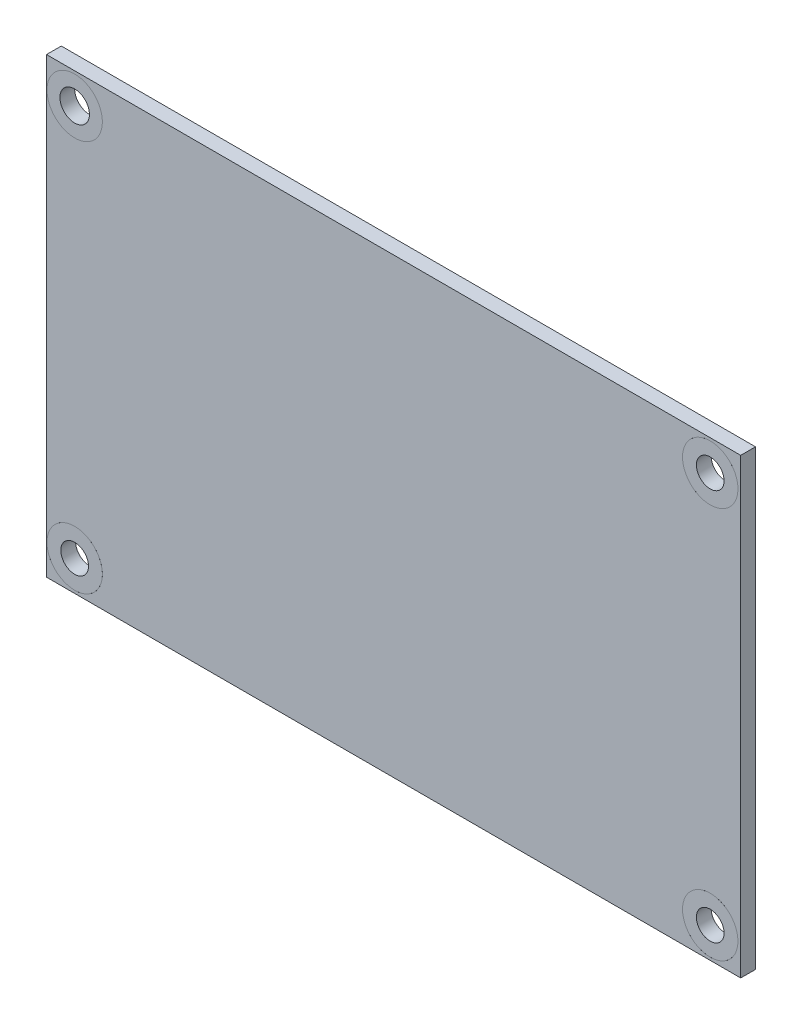
ISO-10303-21;
HEADER;
FILE_DESCRIPTION(('STEP AP214'),'2;1');
FILE_NAME('part.step','',(''),(''),'','','');
FILE_SCHEMA(('AUTOMOTIVE_DESIGN { 1 0 10303 214 1 1 1 1 }'));
ENDSEC;
DATA;
#1=APPLICATION_CONTEXT('core data for automotive mechanical design processes');
#2=APPLICATION_PROTOCOL_DEFINITION('international standard','automotive_design',2000,#1);
#3=PRODUCT_CONTEXT('',#1,'mechanical');
#4=PRODUCT('Part','Part','',(#3));
#5=PRODUCT_RELATED_PRODUCT_CATEGORY('part','',(#4));
#6=PRODUCT_DEFINITION_FORMATION('','',#4);
#7=PRODUCT_DEFINITION_CONTEXT('part definition',#1,'design');
#8=PRODUCT_DEFINITION('design','',#6,#7);
#9=PRODUCT_DEFINITION_SHAPE('','',#8);
#10=(LENGTH_UNIT() NAMED_UNIT(*) SI_UNIT(.MILLI.,.METRE.));
#11=(NAMED_UNIT(*) PLANE_ANGLE_UNIT() SI_UNIT($,.RADIAN.));
#12=(NAMED_UNIT(*) SI_UNIT($,.STERADIAN.) SOLID_ANGLE_UNIT());
#13=UNCERTAINTY_MEASURE_WITH_UNIT(LENGTH_MEASURE(1.E-05),#10,'distance_accuracy_value','');
#14=(GEOMETRIC_REPRESENTATION_CONTEXT(3) GLOBAL_UNCERTAINTY_ASSIGNED_CONTEXT((#13)) GLOBAL_UNIT_ASSIGNED_CONTEXT((#10,
#11,#12)) REPRESENTATION_CONTEXT('',''));
#15=CARTESIAN_POINT('',(0.,0.,0.));
#16=DIRECTION('',(0.,0.,1.));
#17=DIRECTION('',(1.,0.,0.));
#18=AXIS2_PLACEMENT_3D('',#15,#16,#17);
#19=CARTESIAN_POINT('',(-34.54,-21.21,10.0854813742386));
#20=DIRECTION('',(0.,0.,-1.));
#21=DIRECTION('',(-1.,0.,0.));
#22=AXIS2_PLACEMENT_3D('',#19,#20,#21);
#23=CYLINDRICAL_SURFACE('',#22,3.);
#24=CARTESIAN_POINT('',(-34.54,-21.21,0.));
#25=DIRECTION('',(0.,0.,-1.));
#26=DIRECTION('',(-1.,0.,0.));
#27=AXIS2_PLACEMENT_3D('',#24,#25,#26);
#28=CIRCLE('',#27,3.);
#29=CARTESIAN_POINT('',(-37.54,-21.21,0.));
#30=VERTEX_POINT('',#29);
#31=EDGE_CURVE('E61',#30,#30,#28,.T.);
#32=ORIENTED_EDGE('',*,*,#31,.F.);
#33=EDGE_LOOP('',(#32));
#34=FACE_BOUND('',#33,.T.);
#35=CARTESIAN_POINT('',(-34.54,-21.21,1.6002));
#36=DIRECTION('',(0.,0.,1.));
#37=DIRECTION('',(1.,0.,0.));
#38=AXIS2_PLACEMENT_3D('',#35,#36,#37);
#39=CIRCLE('',#38,3.);
#40=CARTESIAN_POINT('',(-31.54,-21.21,1.6002));
#41=VERTEX_POINT('',#40);
#42=EDGE_CURVE('E56',#41,#41,#39,.F.);
#43=ORIENTED_EDGE('',*,*,#42,.T.);
#44=EDGE_LOOP('',(#43));
#45=FACE_BOUND('',#44,.T.);
#46=ADVANCED_FACE('F52',(#34,#45),#23,.T.);
#47=CARTESIAN_POINT('',(-34.54,-21.21,10.0854813742386));
#48=DIRECTION('',(0.,0.,-1.));
#49=DIRECTION('',(-1.,0.,0.));
#50=AXIS2_PLACEMENT_3D('',#47,#48,#49);
#51=CYLINDRICAL_SURFACE('',#50,1.5);
#52=CARTESIAN_POINT('',(-34.54,-21.21,0.));
#53=DIRECTION('',(0.,0.,-1.));
#54=DIRECTION('',(-1.,0.,0.));
#55=AXIS2_PLACEMENT_3D('',#52,#53,#54);
#56=CIRCLE('',#55,1.5);
#57=CARTESIAN_POINT('',(-36.04,-21.21,0.));
#58=VERTEX_POINT('',#57);
#59=EDGE_CURVE('E66',#58,#58,#56,.T.);
#60=ORIENTED_EDGE('',*,*,#59,.T.);
#61=EDGE_LOOP('',(#60));
#62=FACE_BOUND('',#61,.T.);
#63=CARTESIAN_POINT('',(-34.54,-21.21,1.6002));
#64=DIRECTION('',(0.,0.,1.));
#65=DIRECTION('',(1.,0.,0.));
#66=AXIS2_PLACEMENT_3D('',#63,#64,#65);
#67=CIRCLE('',#66,1.5);
#68=CARTESIAN_POINT('',(-33.04,-21.21,1.6002));
#69=VERTEX_POINT('',#68);
#70=EDGE_CURVE('E12',#69,#69,#67,.F.);
#71=ORIENTED_EDGE('',*,*,#70,.F.);
#72=EDGE_LOOP('',(#71));
#73=FACE_BOUND('',#72,.T.);
#74=ADVANCED_FACE('F83',(#62,#73),#51,.F.);
#75=CARTESIAN_POINT('',(-34.54,-21.21,0.));
#76=DIRECTION('',(0.,0.,-1.));
#77=DIRECTION('',(-1.,0.,0.));
#78=AXIS2_PLACEMENT_3D('',#75,#76,#77);
#79=PLANE('',#78);
#80=ORIENTED_EDGE('',*,*,#59,.F.);
#81=EDGE_LOOP('',(#80));
#82=FACE_BOUND('',#81,.T.);
#83=ORIENTED_EDGE('',*,*,#31,.T.);
#84=EDGE_LOOP('',(#83));
#85=FACE_BOUND('',#84,.T.);
#86=ADVANCED_FACE('F80',(#82,#85),#79,.T.);
#87=CARTESIAN_POINT('',(0.,0.,1.6002));
#88=DIRECTION('',(0.,0.,1.));
#89=DIRECTION('',(1.,0.,0.));
#90=AXIS2_PLACEMENT_3D('',#87,#88,#89);
#91=PLANE('',#90);
#92=ORIENTED_EDGE('',*,*,#42,.F.);
#93=EDGE_LOOP('',(#92));
#94=FACE_BOUND('',#93,.T.);
#95=ORIENTED_EDGE('',*,*,#70,.T.);
#96=EDGE_LOOP('',(#95));
#97=FACE_BOUND('',#96,.T.);
#98=ADVANCED_FACE('F54',(#94,#97),#91,.T.);
#99=CLOSED_SHELL('',(#46,#74,#86,#98));
#100=MANIFOLD_SOLID_BREP('B2',#99);
#101=CARTESIAN_POINT('',(34.29,-21.21,10.0854813742386));
#102=DIRECTION('',(0.,0.,-1.));
#103=DIRECTION('',(-1.,0.,0.));
#104=AXIS2_PLACEMENT_3D('',#101,#102,#103);
#105=CYLINDRICAL_SURFACE('',#104,3.);
#106=CARTESIAN_POINT('',(34.29,-21.21,0.));
#107=DIRECTION('',(0.,0.,-1.));
#108=DIRECTION('',(-1.,0.,0.));
#109=AXIS2_PLACEMENT_3D('',#106,#107,#108);
#110=CIRCLE('',#109,3.);
#111=CARTESIAN_POINT('',(31.29,-21.21,0.));
#112=VERTEX_POINT('',#111);
#113=EDGE_CURVE('E143',#112,#112,#110,.T.);
#114=ORIENTED_EDGE('',*,*,#113,.F.);
#115=EDGE_LOOP('',(#114));
#116=FACE_BOUND('',#115,.T.);
#117=CARTESIAN_POINT('',(34.29,-21.21,1.6002));
#118=DIRECTION('',(0.,0.,1.));
#119=DIRECTION('',(1.,0.,0.));
#120=AXIS2_PLACEMENT_3D('',#117,#118,#119);
#121=CIRCLE('',#120,3.);
#122=CARTESIAN_POINT('',(37.29,-21.21,1.6002));
#123=VERTEX_POINT('',#122);
#124=EDGE_CURVE('E138',#123,#123,#121,.F.);
#125=ORIENTED_EDGE('',*,*,#124,.T.);
#126=EDGE_LOOP('',(#125));
#127=FACE_BOUND('',#126,.T.);
#128=ADVANCED_FACE('F134',(#116,#127),#105,.T.);
#129=CARTESIAN_POINT('',(34.29,-21.21,10.0854813742386));
#130=DIRECTION('',(0.,0.,-1.));
#131=DIRECTION('',(-1.,0.,0.));
#132=AXIS2_PLACEMENT_3D('',#129,#130,#131);
#133=CYLINDRICAL_SURFACE('',#132,1.5);
#134=CARTESIAN_POINT('',(34.29,-21.21,0.));
#135=DIRECTION('',(0.,0.,-1.));
#136=DIRECTION('',(-1.,0.,0.));
#137=AXIS2_PLACEMENT_3D('',#134,#135,#136);
#138=CIRCLE('',#137,1.5);
#139=CARTESIAN_POINT('',(32.79,-21.21,0.));
#140=VERTEX_POINT('',#139);
#141=EDGE_CURVE('E148',#140,#140,#138,.T.);
#142=ORIENTED_EDGE('',*,*,#141,.T.);
#143=EDGE_LOOP('',(#142));
#144=FACE_BOUND('',#143,.T.);
#145=CARTESIAN_POINT('',(34.29,-21.21,1.6002));
#146=DIRECTION('',(0.,0.,1.));
#147=DIRECTION('',(1.,0.,0.));
#148=AXIS2_PLACEMENT_3D('',#145,#146,#147);
#149=CIRCLE('',#148,1.5);
#150=CARTESIAN_POINT('',(35.79,-21.21,1.6002));
#151=VERTEX_POINT('',#150);
#152=EDGE_CURVE('E51',#151,#151,#149,.F.);
#153=ORIENTED_EDGE('',*,*,#152,.F.);
#154=EDGE_LOOP('',(#153));
#155=FACE_BOUND('',#154,.T.);
#156=ADVANCED_FACE('F165',(#144,#155),#133,.F.);
#157=CARTESIAN_POINT('',(34.29,-21.21,0.));
#158=DIRECTION('',(0.,0.,-1.));
#159=DIRECTION('',(-1.,0.,0.));
#160=AXIS2_PLACEMENT_3D('',#157,#158,#159);
#161=PLANE('',#160);
#162=ORIENTED_EDGE('',*,*,#141,.F.);
#163=EDGE_LOOP('',(#162));
#164=FACE_BOUND('',#163,.T.);
#165=ORIENTED_EDGE('',*,*,#113,.T.);
#166=EDGE_LOOP('',(#165));
#167=FACE_BOUND('',#166,.T.);
#168=ADVANCED_FACE('F162',(#164,#167),#161,.T.);
#169=CARTESIAN_POINT('',(0.,0.,1.6002));
#170=DIRECTION('',(0.,0.,1.));
#171=DIRECTION('',(1.,0.,0.));
#172=AXIS2_PLACEMENT_3D('',#169,#170,#171);
#173=PLANE('',#172);
#174=ORIENTED_EDGE('',*,*,#124,.F.);
#175=EDGE_LOOP('',(#174));
#176=FACE_BOUND('',#175,.T.);
#177=ORIENTED_EDGE('',*,*,#152,.T.);
#178=EDGE_LOOP('',(#177));
#179=FACE_BOUND('',#178,.T.);
#180=ADVANCED_FACE('F136',(#176,#179),#173,.T.);
#181=CLOSED_SHELL('',(#128,#156,#168,#180));
#182=MANIFOLD_SOLID_BREP('B7',#181);
#183=CARTESIAN_POINT('',(34.29,21.21,10.0854813742386));
#184=DIRECTION('',(0.,0.,-1.));
#185=DIRECTION('',(-1.,0.,0.));
#186=AXIS2_PLACEMENT_3D('',#183,#184,#185);
#187=CYLINDRICAL_SURFACE('',#186,3.00000000000001);
#188=CARTESIAN_POINT('',(34.29,21.21,0.));
#189=DIRECTION('',(0.,0.,-1.));
#190=DIRECTION('',(-1.,0.,0.));
#191=AXIS2_PLACEMENT_3D('',#188,#189,#190);
#192=CIRCLE('',#191,3.00000000000001);
#193=CARTESIAN_POINT('',(31.29,21.21,0.));
#194=VERTEX_POINT('',#193);
#195=EDGE_CURVE('E225',#194,#194,#192,.T.);
#196=ORIENTED_EDGE('',*,*,#195,.F.);
#197=EDGE_LOOP('',(#196));
#198=FACE_BOUND('',#197,.T.);
#199=CARTESIAN_POINT('',(34.29,21.21,1.6002));
#200=DIRECTION('',(0.,0.,1.));
#201=DIRECTION('',(1.,0.,0.));
#202=AXIS2_PLACEMENT_3D('',#199,#200,#201);
#203=CIRCLE('',#202,3.00000000000001);
#204=CARTESIAN_POINT('',(37.29,21.21,1.6002));
#205=VERTEX_POINT('',#204);
#206=EDGE_CURVE('E220',#205,#205,#203,.F.);
#207=ORIENTED_EDGE('',*,*,#206,.T.);
#208=EDGE_LOOP('',(#207));
#209=FACE_BOUND('',#208,.T.);
#210=ADVANCED_FACE('F216',(#198,#209),#187,.T.);
#211=CARTESIAN_POINT('',(34.29,21.21,10.0854813742386));
#212=DIRECTION('',(0.,0.,-1.));
#213=DIRECTION('',(-1.,0.,0.));
#214=AXIS2_PLACEMENT_3D('',#211,#212,#213);
#215=CYLINDRICAL_SURFACE('',#214,1.5);
#216=CARTESIAN_POINT('',(34.29,21.21,0.));
#217=DIRECTION('',(0.,0.,-1.));
#218=DIRECTION('',(-1.,0.,0.));
#219=AXIS2_PLACEMENT_3D('',#216,#217,#218);
#220=CIRCLE('',#219,1.5);
#221=CARTESIAN_POINT('',(32.79,21.21,0.));
#222=VERTEX_POINT('',#221);
#223=EDGE_CURVE('E230',#222,#222,#220,.T.);
#224=ORIENTED_EDGE('',*,*,#223,.T.);
#225=EDGE_LOOP('',(#224));
#226=FACE_BOUND('',#225,.T.);
#227=CARTESIAN_POINT('',(34.29,21.21,1.6002));
#228=DIRECTION('',(0.,0.,1.));
#229=DIRECTION('',(1.,0.,0.));
#230=AXIS2_PLACEMENT_3D('',#227,#228,#229);
#231=CIRCLE('',#230,1.5);
#232=CARTESIAN_POINT('',(35.79,21.21,1.6002));
#233=VERTEX_POINT('',#232);
#234=EDGE_CURVE('E133',#233,#233,#231,.F.);
#235=ORIENTED_EDGE('',*,*,#234,.F.);
#236=EDGE_LOOP('',(#235));
#237=FACE_BOUND('',#236,.T.);
#238=ADVANCED_FACE('F247',(#226,#237),#215,.F.);
#239=CARTESIAN_POINT('',(34.29,21.21,0.));
#240=DIRECTION('',(0.,0.,-1.));
#241=DIRECTION('',(-1.,0.,0.));
#242=AXIS2_PLACEMENT_3D('',#239,#240,#241);
#243=PLANE('',#242);
#244=ORIENTED_EDGE('',*,*,#223,.F.);
#245=EDGE_LOOP('',(#244));
#246=FACE_BOUND('',#245,.T.);
#247=ORIENTED_EDGE('',*,*,#195,.T.);
#248=EDGE_LOOP('',(#247));
#249=FACE_BOUND('',#248,.T.);
#250=ADVANCED_FACE('F244',(#246,#249),#243,.T.);
#251=CARTESIAN_POINT('',(0.,0.,1.6002));
#252=DIRECTION('',(0.,0.,1.));
#253=DIRECTION('',(1.,0.,0.));
#254=AXIS2_PLACEMENT_3D('',#251,#252,#253);
#255=PLANE('',#254);
#256=ORIENTED_EDGE('',*,*,#206,.F.);
#257=EDGE_LOOP('',(#256));
#258=FACE_BOUND('',#257,.T.);
#259=ORIENTED_EDGE('',*,*,#234,.T.);
#260=EDGE_LOOP('',(#259));
#261=FACE_BOUND('',#260,.T.);
#262=ADVANCED_FACE('F218',(#258,#261),#255,.T.);
#263=CLOSED_SHELL('',(#210,#238,#250,#262));
#264=MANIFOLD_SOLID_BREP('B46',#263);
#265=CARTESIAN_POINT('',(-34.54,21.21,-8.48528137423858));
#266=DIRECTION('',(0.,0.,1.));
#267=DIRECTION('',(1.,0.,0.));
#268=AXIS2_PLACEMENT_3D('',#265,#266,#267);
#269=CYLINDRICAL_SURFACE('',#268,3.);
#270=CARTESIAN_POINT('',(-34.54,21.21,0.));
#271=DIRECTION('',(0.,0.,1.));
#272=DIRECTION('',(1.,0.,0.));
#273=AXIS2_PLACEMENT_3D('',#270,#271,#272);
#274=CIRCLE('',#273,3.);
#275=CARTESIAN_POINT('',(-31.54,21.21,0.));
#276=VERTEX_POINT('',#275);
#277=EDGE_CURVE('E306',#276,#276,#274,.F.);
#278=ORIENTED_EDGE('',*,*,#277,.F.);
#279=EDGE_LOOP('',(#278));
#280=FACE_BOUND('',#279,.T.);
#281=CARTESIAN_POINT('',(-34.54,21.21,1.6002));
#282=DIRECTION('',(0.,0.,1.));
#283=DIRECTION('',(1.,0.,0.));
#284=AXIS2_PLACEMENT_3D('',#281,#282,#283);
#285=CIRCLE('',#284,3.);
#286=CARTESIAN_POINT('',(-31.54,21.21,1.6002));
#287=VERTEX_POINT('',#286);
#288=EDGE_CURVE('E311',#287,#287,#285,.T.);
#289=ORIENTED_EDGE('',*,*,#288,.F.);
#290=EDGE_LOOP('',(#289));
#291=FACE_BOUND('',#290,.T.);
#292=ADVANCED_FACE('F299',(#280,#291),#269,.T.);
#293=CARTESIAN_POINT('',(-34.54,21.21,1.6002));
#294=DIRECTION('',(0.,0.,1.));
#295=DIRECTION('',(1.,0.,0.));
#296=AXIS2_PLACEMENT_3D('',#293,#294,#295);
#297=PLANE('',#296);
#298=CARTESIAN_POINT('',(-34.54,21.21,1.6002));
#299=DIRECTION('',(0.,0.,1.));
#300=DIRECTION('',(1.,0.,0.));
#301=AXIS2_PLACEMENT_3D('',#298,#299,#300);
#302=CIRCLE('',#301,1.6);
#303=CARTESIAN_POINT('',(-32.94,21.21,1.6002));
#304=VERTEX_POINT('',#303);
#305=EDGE_CURVE('E317',#304,#304,#302,.T.);
#306=ORIENTED_EDGE('',*,*,#305,.F.);
#307=EDGE_LOOP('',(#306));
#308=FACE_BOUND('',#307,.T.);
#309=ORIENTED_EDGE('',*,*,#288,.T.);
#310=EDGE_LOOP('',(#309));
#311=FACE_BOUND('',#310,.T.);
#312=ADVANCED_FACE('F326',(#308,#311),#297,.T.);
#313=CARTESIAN_POINT('',(-34.54,21.21,-8.48528137423858));
#314=DIRECTION('',(0.,0.,1.));
#315=DIRECTION('',(1.,0.,0.));
#316=AXIS2_PLACEMENT_3D('',#313,#314,#315);
#317=CYLINDRICAL_SURFACE('',#316,1.6);
#318=CARTESIAN_POINT('',(-34.54,21.21,0.));
#319=DIRECTION('',(0.,0.,1.));
#320=DIRECTION('',(1.,0.,0.));
#321=AXIS2_PLACEMENT_3D('',#318,#319,#320);
#322=CIRCLE('',#321,1.6);
#323=CARTESIAN_POINT('',(-32.94,21.21,0.));
#324=VERTEX_POINT('',#323);
#325=EDGE_CURVE('E215',#324,#324,#322,.F.);
#326=ORIENTED_EDGE('',*,*,#325,.T.);
#327=EDGE_LOOP('',(#326));
#328=FACE_BOUND('',#327,.T.);
#329=ORIENTED_EDGE('',*,*,#305,.T.);
#330=EDGE_LOOP('',(#329));
#331=FACE_BOUND('',#330,.T.);
#332=ADVANCED_FACE('F324',(#328,#331),#317,.F.);
#333=CARTESIAN_POINT('',(0.,0.,0.));
#334=DIRECTION('',(0.,0.,1.));
#335=DIRECTION('',(1.,0.,0.));
#336=AXIS2_PLACEMENT_3D('',#333,#334,#335);
#337=PLANE('',#336);
#338=ORIENTED_EDGE('',*,*,#277,.T.);
#339=EDGE_LOOP('',(#338));
#340=FACE_BOUND('',#339,.T.);
#341=ORIENTED_EDGE('',*,*,#325,.F.);
#342=EDGE_LOOP('',(#341));
#343=FACE_BOUND('',#342,.T.);
#344=ADVANCED_FACE('F342',(#340,#343),#337,.F.);
#345=CLOSED_SHELL('',(#292,#312,#332,#344));
#346=MANIFOLD_SOLID_BREP('B128',#345);
#347=CARTESIAN_POINT('',(0.,0.,0.));
#348=DIRECTION('',(0.,0.,1.));
#349=DIRECTION('',(1.,0.,0.));
#350=AXIS2_PLACEMENT_3D('',#347,#348,#349);
#351=PLANE('',#350);
#352=CARTESIAN_POINT('',(-34.54,-21.21,0.));
#353=DIRECTION('',(0.,0.,-1.));
#354=DIRECTION('',(-1.,0.,0.));
#355=AXIS2_PLACEMENT_3D('',#352,#353,#354);
#356=CIRCLE('',#355,3.);
#357=CARTESIAN_POINT('',(-37.54,-21.21,0.));
#358=VERTEX_POINT('',#357);
#359=EDGE_CURVE('E459',#358,#358,#356,.T.);
#360=ORIENTED_EDGE('',*,*,#359,.F.);
#361=EDGE_LOOP('',(#360));
#362=FACE_BOUND('',#361,.T.);
#363=CARTESIAN_POINT('',(34.29,-21.21,0.));
#364=DIRECTION('',(0.,0.,-1.));
#365=DIRECTION('',(-1.,0.,0.));
#366=AXIS2_PLACEMENT_3D('',#363,#364,#365);
#367=CIRCLE('',#366,3.);
#368=CARTESIAN_POINT('',(31.29,-21.21,0.));
#369=VERTEX_POINT('',#368);
#370=EDGE_CURVE('E471',#369,#369,#367,.T.);
#371=ORIENTED_EDGE('',*,*,#370,.F.);
#372=EDGE_LOOP('',(#371));
#373=FACE_BOUND('',#372,.T.);
#374=CARTESIAN_POINT('',(34.29,21.21,0.));
#375=DIRECTION('',(0.,0.,-1.));
#376=DIRECTION('',(-1.,0.,0.));
#377=AXIS2_PLACEMENT_3D('',#374,#375,#376);
#378=CIRCLE('',#377,3.);
#379=CARTESIAN_POINT('',(31.29,21.21,0.));
#380=VERTEX_POINT('',#379);
#381=EDGE_CURVE('E485',#380,#380,#378,.T.);
#382=ORIENTED_EDGE('',*,*,#381,.F.);
#383=EDGE_LOOP('',(#382));
#384=FACE_BOUND('',#383,.T.);
#385=CARTESIAN_POINT('',(-34.54,21.21,0.));
#386=DIRECTION('',(0.,0.,1.));
#387=DIRECTION('',(1.,0.,0.));
#388=AXIS2_PLACEMENT_3D('',#385,#386,#387);
#389=CIRCLE('',#388,3.);
#390=CARTESIAN_POINT('',(-31.54,21.21,0.));
#391=VERTEX_POINT('',#390);
#392=EDGE_CURVE('E429',#391,#391,#389,.T.);
#393=ORIENTED_EDGE('',*,*,#392,.T.);
#394=EDGE_LOOP('',(#393));
#395=FACE_BOUND('',#394,.T.);
#396=DIRECTION('',(1.,0.,0.));
#397=VECTOR('',#396,1.);
#398=CARTESIAN_POINT('',(-37.59,-24.51,0.));
#399=LINE('',#398,#397);
#400=CARTESIAN_POINT('',(-37.59,-24.51,0.));
#401=VERTEX_POINT('',#400);
#402=CARTESIAN_POINT('',(37.59,-24.51,0.));
#403=VERTEX_POINT('',#402);
#404=EDGE_CURVE('E442',#401,#403,#399,.T.);
#405=ORIENTED_EDGE('',*,*,#404,.F.);
#406=DIRECTION('',(0.,1.,0.));
#407=VECTOR('',#406,1.);
#408=CARTESIAN_POINT('',(-37.59,24.51,0.));
#409=LINE('',#408,#407);
#410=CARTESIAN_POINT('',(-37.59,24.51,0.));
#411=VERTEX_POINT('',#410);
#412=EDGE_CURVE('E412',#411,#401,#409,.F.);
#413=ORIENTED_EDGE('',*,*,#412,.F.);
#414=DIRECTION('',(1.,0.,0.));
#415=VECTOR('',#414,1.);
#416=CARTESIAN_POINT('',(37.59,24.51,0.));
#417=LINE('',#416,#415);
#418=CARTESIAN_POINT('',(37.59,24.51,0.));
#419=VERTEX_POINT('',#418);
#420=EDGE_CURVE('E414',#419,#411,#417,.F.);
#421=ORIENTED_EDGE('',*,*,#420,.F.);
#422=DIRECTION('',(0.,1.,0.));
#423=VECTOR('',#422,1.);
#424=CARTESIAN_POINT('',(37.59,-24.51,0.));
#425=LINE('',#424,#423);
#426=EDGE_CURVE('E375',#403,#419,#425,.T.);
#427=ORIENTED_EDGE('',*,*,#426,.F.);
#428=EDGE_LOOP('',(#405,#413,#421,#427));
#429=FACE_BOUND('',#428,.T.);
#430=ADVANCED_FACE('F372',(#362,#373,#384,#395,#429),#351,.F.);
#431=CARTESIAN_POINT('',(37.59,-24.51,0.));
#432=DIRECTION('',(1.,0.,0.));
#433=DIRECTION('',(0.,0.,-1.));
#434=AXIS2_PLACEMENT_3D('',#431,#432,#433);
#435=PLANE('',#434);
#436=DIRECTION('',(0.,1.,0.));
#437=VECTOR('',#436,1.);
#438=CARTESIAN_POINT('',(37.59,0.,1.6002));
#439=LINE('',#438,#437);
#440=CARTESIAN_POINT('',(37.59,-24.51,1.6002));
#441=VERTEX_POINT('',#440);
#442=CARTESIAN_POINT('',(37.59,24.51,1.6002));
#443=VERTEX_POINT('',#442);
#444=EDGE_CURVE('E512',#441,#443,#439,.T.);
#445=ORIENTED_EDGE('',*,*,#444,.F.);
#446=DIRECTION('',(0.,0.,-1.));
#447=VECTOR('',#446,1.);
#448=CARTESIAN_POINT('',(37.59,-24.51,0.));
#449=LINE('',#448,#447);
#450=EDGE_CURVE('E426',#403,#441,#449,.F.);
#451=ORIENTED_EDGE('',*,*,#450,.F.);
#452=ORIENTED_EDGE('',*,*,#426,.T.);
#453=DIRECTION('',(0.,0.,1.));
#454=VECTOR('',#453,1.);
#455=CARTESIAN_POINT('',(37.59,24.51,0.));
#456=LINE('',#455,#454);
#457=EDGE_CURVE('E421',#443,#419,#456,.F.);
#458=ORIENTED_EDGE('',*,*,#457,.F.);
#459=EDGE_LOOP('',(#445,#451,#452,#458));
#460=FACE_BOUND('',#459,.T.);
#461=ADVANCED_FACE('F423',(#460),#435,.T.);
#462=CARTESIAN_POINT('',(37.59,24.51,0.));
#463=DIRECTION('',(0.,1.,0.));
#464=DIRECTION('',(0.,0.,1.));
#465=AXIS2_PLACEMENT_3D('',#462,#463,#464);
#466=PLANE('',#465);
#467=DIRECTION('',(1.,0.,0.));
#468=VECTOR('',#467,1.);
#469=CARTESIAN_POINT('',(0.,24.51,1.6002));
#470=LINE('',#469,#468);
#471=CARTESIAN_POINT('',(-37.59,24.51,1.6002));
#472=VERTEX_POINT('',#471);
#473=EDGE_CURVE('E432',#443,#472,#470,.F.);
#474=ORIENTED_EDGE('',*,*,#473,.F.);
#475=ORIENTED_EDGE('',*,*,#457,.T.);
#476=ORIENTED_EDGE('',*,*,#420,.T.);
#477=DIRECTION('',(0.,0.,1.));
#478=VECTOR('',#477,1.);
#479=CARTESIAN_POINT('',(-37.59,24.51,0.));
#480=LINE('',#479,#478);
#481=EDGE_CURVE('E437',#472,#411,#480,.F.);
#482=ORIENTED_EDGE('',*,*,#481,.F.);
#483=EDGE_LOOP('',(#474,#475,#476,#482));
#484=FACE_BOUND('',#483,.T.);
#485=ADVANCED_FACE('F430',(#484),#466,.T.);
#486=CARTESIAN_POINT('',(-37.59,24.51,0.));
#487=DIRECTION('',(-1.,0.,0.));
#488=DIRECTION('',(0.,0.,1.));
#489=AXIS2_PLACEMENT_3D('',#486,#487,#488);
#490=PLANE('',#489);
#491=DIRECTION('',(0.,1.,0.));
#492=VECTOR('',#491,1.);
#493=CARTESIAN_POINT('',(-37.59,0.,1.6002));
#494=LINE('',#493,#492);
#495=CARTESIAN_POINT('',(-37.59,-24.51,1.6002));
#496=VERTEX_POINT('',#495);
#497=EDGE_CURVE('E383',#472,#496,#494,.F.);
#498=ORIENTED_EDGE('',*,*,#497,.F.);
#499=ORIENTED_EDGE('',*,*,#481,.T.);
#500=ORIENTED_EDGE('',*,*,#412,.T.);
#501=DIRECTION('',(0.,0.,-1.));
#502=VECTOR('',#501,1.);
#503=CARTESIAN_POINT('',(-37.59,-24.51,0.));
#504=LINE('',#503,#502);
#505=EDGE_CURVE('E392',#496,#401,#504,.T.);
#506=ORIENTED_EDGE('',*,*,#505,.F.);
#507=EDGE_LOOP('',(#498,#499,#500,#506));
#508=FACE_BOUND('',#507,.T.);
#509=ADVANCED_FACE('F525',(#508),#490,.T.);
#510=CARTESIAN_POINT('',(-37.59,-24.51,0.));
#511=DIRECTION('',(0.,-1.,0.));
#512=DIRECTION('',(0.,0.,-1.));
#513=AXIS2_PLACEMENT_3D('',#510,#511,#512);
#514=PLANE('',#513);
#515=DIRECTION('',(1.,0.,0.));
#516=VECTOR('',#515,1.);
#517=CARTESIAN_POINT('',(0.,-24.51,1.6002));
#518=LINE('',#517,#516);
#519=EDGE_CURVE('E297',#496,#441,#518,.T.);
#520=ORIENTED_EDGE('',*,*,#519,.F.);
#521=ORIENTED_EDGE('',*,*,#505,.T.);
#522=ORIENTED_EDGE('',*,*,#404,.T.);
#523=ORIENTED_EDGE('',*,*,#450,.T.);
#524=EDGE_LOOP('',(#520,#521,#522,#523));
#525=FACE_BOUND('',#524,.T.);
#526=ADVANCED_FACE('F519',(#525),#514,.T.);
#527=CARTESIAN_POINT('',(0.,0.,1.6002));
#528=DIRECTION('',(0.,0.,1.));
#529=DIRECTION('',(1.,0.,0.));
#530=AXIS2_PLACEMENT_3D('',#527,#528,#529);
#531=PLANE('',#530);
#532=CARTESIAN_POINT('',(-34.54,-21.21,1.6002));
#533=DIRECTION('',(0.,0.,-1.));
#534=DIRECTION('',(-1.,0.,0.));
#535=AXIS2_PLACEMENT_3D('',#532,#533,#534);
#536=CIRCLE('',#535,3.);
#537=CARTESIAN_POINT('',(-37.54,-21.21,1.6002));
#538=VERTEX_POINT('',#537);
#539=EDGE_CURVE('E465',#538,#538,#536,.T.);
#540=ORIENTED_EDGE('',*,*,#539,.T.);
#541=EDGE_LOOP('',(#540));
#542=FACE_BOUND('',#541,.T.);
#543=CARTESIAN_POINT('',(34.29,-21.21,1.6002));
#544=DIRECTION('',(0.,0.,-1.));
#545=DIRECTION('',(-1.,0.,0.));
#546=AXIS2_PLACEMENT_3D('',#543,#544,#545);
#547=CIRCLE('',#546,3.);
#548=CARTESIAN_POINT('',(31.29,-21.21,1.6002));
#549=VERTEX_POINT('',#548);
#550=EDGE_CURVE('E466',#549,#549,#547,.T.);
#551=ORIENTED_EDGE('',*,*,#550,.T.);
#552=EDGE_LOOP('',(#551));
#553=FACE_BOUND('',#552,.T.);
#554=CARTESIAN_POINT('',(34.29,21.21,1.6002));
#555=DIRECTION('',(0.,0.,-1.));
#556=DIRECTION('',(-1.,0.,0.));
#557=AXIS2_PLACEMENT_3D('',#554,#555,#556);
#558=CIRCLE('',#557,3.);
#559=CARTESIAN_POINT('',(31.29,21.21,1.6002));
#560=VERTEX_POINT('',#559);
#561=EDGE_CURVE('E480',#560,#560,#558,.T.);
#562=ORIENTED_EDGE('',*,*,#561,.T.);
#563=EDGE_LOOP('',(#562));
#564=FACE_BOUND('',#563,.T.);
#565=CARTESIAN_POINT('',(-34.54,21.21,1.6002));
#566=DIRECTION('',(0.,0.,1.));
#567=DIRECTION('',(1.,0.,0.));
#568=AXIS2_PLACEMENT_3D('',#565,#566,#567);
#569=CIRCLE('',#568,3.);
#570=CARTESIAN_POINT('',(-31.54,21.21,1.6002));
#571=VERTEX_POINT('',#570);
#572=EDGE_CURVE('E494',#571,#571,#569,.T.);
#573=ORIENTED_EDGE('',*,*,#572,.F.);
#574=EDGE_LOOP('',(#573));
#575=FACE_BOUND('',#574,.T.);
#576=ORIENTED_EDGE('',*,*,#497,.T.);
#577=ORIENTED_EDGE('',*,*,#519,.T.);
#578=ORIENTED_EDGE('',*,*,#444,.T.);
#579=ORIENTED_EDGE('',*,*,#473,.T.);
#580=EDGE_LOOP('',(#576,#577,#578,#579));
#581=FACE_BOUND('',#580,.T.);
#582=ADVANCED_FACE('F522',(#542,#553,#564,#575,#581),#531,.T.);
#583=CARTESIAN_POINT('',(-34.54,21.21,0.));
#584=DIRECTION('',(0.,0.,1.));
#585=DIRECTION('',(1.,0.,0.));
#586=AXIS2_PLACEMENT_3D('',#583,#584,#585);
#587=CYLINDRICAL_SURFACE('',#586,3.);
#588=ORIENTED_EDGE('',*,*,#392,.F.);
#589=EDGE_LOOP('',(#588));
#590=FACE_BOUND('',#589,.T.);
#591=ORIENTED_EDGE('',*,*,#572,.T.);
#592=EDGE_LOOP('',(#591));
#593=FACE_BOUND('',#592,.T.);
#594=ADVANCED_FACE('F534',(#590,#593),#587,.F.);
#595=CARTESIAN_POINT('',(34.29,21.21,1.6002));
#596=DIRECTION('',(0.,0.,-1.));
#597=DIRECTION('',(-1.,0.,0.));
#598=AXIS2_PLACEMENT_3D('',#595,#596,#597);
#599=CYLINDRICAL_SURFACE('',#598,3.);
#600=ORIENTED_EDGE('',*,*,#561,.F.);
#601=EDGE_LOOP('',(#600));
#602=FACE_BOUND('',#601,.T.);
#603=ORIENTED_EDGE('',*,*,#381,.T.);
#604=EDGE_LOOP('',(#603));
#605=FACE_BOUND('',#604,.T.);
#606=ADVANCED_FACE('F539',(#602,#605),#599,.F.);
#607=CARTESIAN_POINT('',(34.29,-21.21,1.6002));
#608=DIRECTION('',(0.,0.,-1.));
#609=DIRECTION('',(-1.,0.,0.));
#610=AXIS2_PLACEMENT_3D('',#607,#608,#609);
#611=CYLINDRICAL_SURFACE('',#610,3.);
#612=ORIENTED_EDGE('',*,*,#550,.F.);
#613=EDGE_LOOP('',(#612));
#614=FACE_BOUND('',#613,.T.);
#615=ORIENTED_EDGE('',*,*,#370,.T.);
#616=EDGE_LOOP('',(#615));
#617=FACE_BOUND('',#616,.T.);
#618=ADVANCED_FACE('F547',(#614,#617),#611,.F.);
#619=CARTESIAN_POINT('',(-34.54,-21.21,1.6002));
#620=DIRECTION('',(0.,0.,-1.));
#621=DIRECTION('',(-1.,0.,0.));
#622=AXIS2_PLACEMENT_3D('',#619,#620,#621);
#623=CYLINDRICAL_SURFACE('',#622,3.);
#624=ORIENTED_EDGE('',*,*,#539,.F.);
#625=EDGE_LOOP('',(#624));
#626=FACE_BOUND('',#625,.T.);
#627=ORIENTED_EDGE('',*,*,#359,.T.);
#628=EDGE_LOOP('',(#627));
#629=FACE_BOUND('',#628,.T.);
#630=ADVANCED_FACE('F551',(#626,#629),#623,.F.);
#631=CLOSED_SHELL('',(#430,#461,#485,#509,#526,#582,#594,#606,#618,#630));
#632=MANIFOLD_SOLID_BREP('B210',#631);
#633=ADVANCED_BREP_SHAPE_REPRESENTATION('',(#18,#100,#182,#264,#346,#632),#14);
#634=SHAPE_DEFINITION_REPRESENTATION(#9,#633);
ENDSEC;
END-ISO-10303-21;
